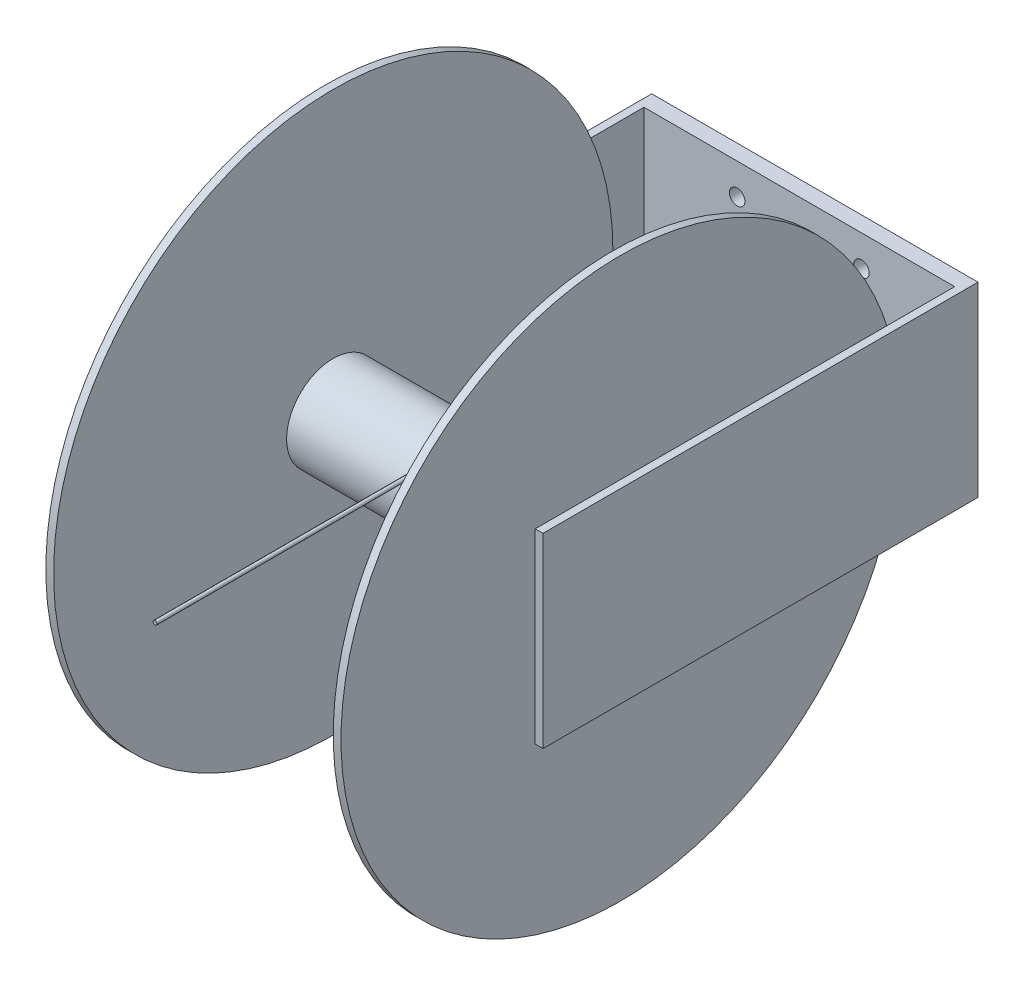
ISO-10303-21;
HEADER;
FILE_DESCRIPTION(('STEP AP214'),'2;1');
FILE_NAME('part.step','',(''),(''),'','','');
FILE_SCHEMA(('AUTOMOTIVE_DESIGN { 1 0 10303 214 1 1 1 1 }'));
ENDSEC;
DATA;
#1=APPLICATION_CONTEXT('core data for automotive mechanical design processes');
#2=APPLICATION_PROTOCOL_DEFINITION('international standard','automotive_design',2000,#1);
#3=PRODUCT_CONTEXT('',#1,'mechanical');
#4=PRODUCT('Part','Part','',(#3));
#5=PRODUCT_RELATED_PRODUCT_CATEGORY('part','',(#4));
#6=PRODUCT_DEFINITION_FORMATION('','',#4);
#7=PRODUCT_DEFINITION_CONTEXT('part definition',#1,'design');
#8=PRODUCT_DEFINITION('design','',#6,#7);
#9=PRODUCT_DEFINITION_SHAPE('','',#8);
#10=(LENGTH_UNIT() NAMED_UNIT(*) SI_UNIT(.MILLI.,.METRE.));
#11=(NAMED_UNIT(*) PLANE_ANGLE_UNIT() SI_UNIT($,.RADIAN.));
#12=(NAMED_UNIT(*) SI_UNIT($,.STERADIAN.) SOLID_ANGLE_UNIT());
#13=UNCERTAINTY_MEASURE_WITH_UNIT(LENGTH_MEASURE(1.E-05),#10,'distance_accuracy_value','');
#14=(GEOMETRIC_REPRESENTATION_CONTEXT(3) GLOBAL_UNCERTAINTY_ASSIGNED_CONTEXT((#13)) GLOBAL_UNIT_ASSIGNED_CONTEXT((#10,
#11,#12)) REPRESENTATION_CONTEXT('',''));
#15=CARTESIAN_POINT('',(0.,0.,0.));
#16=DIRECTION('',(0.,0.,1.));
#17=DIRECTION('',(1.,0.,0.));
#18=AXIS2_PLACEMENT_3D('',#15,#16,#17);
#19=CARTESIAN_POINT('',(234.95,0.,0.));
#20=DIRECTION('',(-1.,0.,0.));
#21=DIRECTION('',(0.,0.,1.));
#22=AXIS2_PLACEMENT_3D('',#19,#20,#21);
#23=CYLINDRICAL_SURFACE('',#22,38.1);
#24=CARTESIAN_POINT('',(6.35,0.,0.));
#25=DIRECTION('',(1.,0.,0.));
#26=DIRECTION('',(0.,0.,-1.));
#27=AXIS2_PLACEMENT_3D('',#24,#25,#26);
#28=CIRCLE('',#27,38.1);
#29=CARTESIAN_POINT('',(6.35,0.,-38.1));
#30=VERTEX_POINT('',#29);
#31=EDGE_CURVE('E270',#30,#30,#28,.T.);
#32=ORIENTED_EDGE('',*,*,#31,.T.);
#33=EDGE_LOOP('',(#32));
#34=FACE_BOUND('',#33,.T.);
#35=CARTESIAN_POINT('',(234.95,0.,0.));
#36=DIRECTION('',(1.,0.,0.));
#37=DIRECTION('',(0.,0.,-1.));
#38=AXIS2_PLACEMENT_3D('',#35,#36,#37);
#39=CIRCLE('',#38,38.1);
#40=CARTESIAN_POINT('',(234.95,0.,-38.1));
#41=VERTEX_POINT('',#40);
#42=EDGE_CURVE('E273',#41,#41,#39,.T.);
#43=ORIENTED_EDGE('',*,*,#42,.F.);
#44=EDGE_LOOP('',(#43));
#45=FACE_BOUND('',#44,.T.);
#46=DIRECTION('',(-1.,0.,0.));
#47=VECTOR('',#46,1.);
#48=CARTESIAN_POINT('',(234.95,0.,-38.1));
#49=LINE('',#48,#47);
#50=CARTESIAN_POINT('',(122.24,0.,-38.1));
#51=VERTEX_POINT('',#50);
#52=CARTESIAN_POINT('',(119.06,0.,-38.1));
#53=VERTEX_POINT('',#52);
#54=EDGE_CURVE('E11',#51,#53,#49,.T.);
#55=ORIENTED_EDGE('',*,*,#54,.F.);
#56=CARTESIAN_POINT('',(122.24,0.,0.));
#57=DIRECTION('',(-1.,0.,0.));
#58=DIRECTION('',(0.,0.,1.));
#59=AXIS2_PLACEMENT_3D('',#56,#57,#58);
#60=CIRCLE('',#59,38.1);
#61=CARTESIAN_POINT('',(122.24,38.1,0.));
#62=VERTEX_POINT('',#61);
#63=EDGE_CURVE('E50',#51,#62,#60,.F.);
#64=ORIENTED_EDGE('',*,*,#63,.T.);
#65=CARTESIAN_POINT('',(122.24,38.1,0.));
#66=CARTESIAN_POINT('',(122.239969843095,38.1000004161451,0.263155413808071));
#67=CARTESIAN_POINT('',(122.239998942787,38.0972736057618,0.526310736584829));
#68=CARTESIAN_POINT('',(122.239958978122,38.0863663180607,1.05261546876357));
#69=CARTESIAN_POINT('',(122.239889873808,38.0781836216027,1.31576483216942));
#70=CARTESIAN_POINT('',(122.239432877307,38.0561912266324,1.84603595109456));
#71=CARTESIAN_POINT('',(122.23903991443,38.0422937980502,2.11315407003681));
#72=CARTESIAN_POINT('',(122.237475772565,38.0088838478478,2.646927723857));
#73=CARTESIAN_POINT('',(122.236304910877,37.9893736174925,2.91358340291642));
#74=CARTESIAN_POINT('',(122.232545223609,37.944564627655,3.44857246255277));
#75=CARTESIAN_POINT('',(122.229945000416,37.9192203044745,3.71690195813133));
#76=CARTESIAN_POINT('',(122.222471621423,37.862844960689,4.25295275488759));
#77=CARTESIAN_POINT('',(122.21759830794,37.831813545664,4.52067401257729));
#78=CARTESIAN_POINT('',(122.204480048913,37.7640120175987,5.05592025545366));
#79=CARTESIAN_POINT('',(122.196227576689,37.7272292077921,5.32344345822355));
#80=CARTESIAN_POINT('',(122.174958659612,37.6480192529511,5.85742947218407));
#81=CARTESIAN_POINT('',(122.161942990631,37.605593027882,6.12389244893203));
#82=CARTESIAN_POINT('',(122.129557153402,37.5158304217406,6.65154314826663));
#83=CARTESIAN_POINT('',(122.110283835843,37.4685759611548,6.91275059671003));
#84=CARTESIAN_POINT('',(122.062950882956,37.3687346803761,7.433570740661));
#85=CARTESIAN_POINT('',(122.034885660134,37.3161444835894,7.69318231466648));
#86=CARTESIAN_POINT('',(121.98359070811,37.2335902820844,8.08004124599994));
#87=CARTESIAN_POINT('',(121.96500627531,37.2055210832138,8.20831137384597));
#88=CARTESIAN_POINT('',(121.924128812276,37.1481908842843,8.46398650786794));
#89=CARTESIAN_POINT('',(121.901836183779,37.1189300135873,8.59139160620452));
#90=CARTESIAN_POINT('',(121.852747683156,37.0593335935228,8.84492704914932));
#91=CARTESIAN_POINT('',(121.825956957555,37.0289993032702,8.97105867791002));
#92=CARTESIAN_POINT('',(121.766726769547,36.9673670338524,9.22173574509855));
#93=CARTESIAN_POINT('',(121.734289425277,36.9360694196561,9.34628175958211));
#94=CARTESIAN_POINT('',(121.683729726594,36.8917503436196,9.51899985894595));
#95=CARTESIAN_POINT('',(121.668696250618,36.8790306671258,9.56815846415023));
#96=CARTESIAN_POINT('',(121.637290614157,36.8534976108575,9.66603696315275));
#97=CARTESIAN_POINT('',(121.620918156103,36.8406842108335,9.71475675674618));
#98=CARTESIAN_POINT('',(121.586533195724,36.8149043905008,9.81200098548411));
#99=CARTESIAN_POINT('',(121.568509601341,36.8019375357816,9.8605214032649));
#100=CARTESIAN_POINT('',(121.530696568847,36.7759913058391,9.95685449209732));
#101=CARTESIAN_POINT('',(121.510907545198,36.7630119342584,10.0046673262089));
#102=CARTESIAN_POINT('',(121.463881532591,36.7337449999586,10.1116663390797));
#103=CARTESIAN_POINT('',(121.436042202015,36.7174703262293,10.1705946416461));
#104=CARTESIAN_POINT('',(121.376326991115,36.6851846071208,10.2864395701272));
#105=CARTESIAN_POINT('',(121.344453182936,36.6691734311436,10.3433572096766));
#106=CARTESIAN_POINT('',(121.275837808016,36.6378641203528,10.4537157976531));
#107=CARTESIAN_POINT('',(121.239140129186,36.6225610644857,10.5071822825237));
#108=CARTESIAN_POINT('',(121.159177020163,36.5931300729919,10.6092229873517));
#109=CARTESIAN_POINT('',(121.115937803826,36.5789977807712,10.6578155009806));
#110=CARTESIAN_POINT('',(121.040227643619,36.5583565800884,10.7283420501423));
#111=CARTESIAN_POINT('',(121.010581569053,36.5510931306797,10.7530529301458));
#112=CARTESIAN_POINT('',(120.94784539167,36.5378180007853,10.7980739461555));
#113=CARTESIAN_POINT('',(120.914762896266,36.5318036401208,10.8183935085296));
#114=CARTESIAN_POINT('',(120.854719749063,36.5230285427257,10.8479748161292));
#115=CARTESIAN_POINT('',(120.82857412385,36.5198278809154,10.8587408251734));
#116=CARTESIAN_POINT('',(120.774791300026,36.5146754085366,10.8760545329939));
#117=CARTESIAN_POINT('',(120.747155582919,36.5127223814742,10.8826063408283));
#118=CARTESIAN_POINT('',(120.690880030731,36.5102749141819,10.8908147496676));
#119=CARTESIAN_POINT('',(120.662234480347,36.5097908778629,10.8924364339366));
#120=CARTESIAN_POINT('',(120.605140378659,36.5103764849778,10.8904733445936));
#121=CARTESIAN_POINT('',(120.576691844065,36.5114462586188,10.8868881346511));
#122=CARTESIAN_POINT('',(120.523571604254,36.5148316884153,10.8755274024679));
#123=CARTESIAN_POINT('',(120.498796758475,36.5170203119781,10.8681790187873));
#124=CARTESIAN_POINT('',(120.450595395759,36.5223667507563,10.850198855739));
#125=CARTESIAN_POINT('',(120.427169497509,36.5255250065489,10.839565583785));
#126=CARTESIAN_POINT('',(120.36606624085,36.5350727141602,10.807354074565));
#127=CARTESIAN_POINT('',(120.329810278151,36.5421816424694,10.7833075005775));
#128=CARTESIAN_POINT('',(120.261471378718,36.5577992675802,10.7302415087662));
#129=CARTESIAN_POINT('',(120.22940317502,36.5663126798161,10.7012053245945));
#130=CARTESIAN_POINT('',(120.16991937712,36.5839034773035,10.640909781304));
#131=CARTESIAN_POINT('',(120.142382867907,36.5929519396047,10.6097592320349));
#132=CARTESIAN_POINT('',(120.090119123394,36.6115768103337,10.5453103852001));
#133=CARTESIAN_POINT('',(120.065394726753,36.6211537379885,10.5120099696901));
#134=CARTESIAN_POINT('',(120.018270777876,36.6406613809053,10.4438113096789));
#135=CARTESIAN_POINT('',(119.995876091037,36.6505927806093,10.4089099322464));
#136=CARTESIAN_POINT('',(119.953111662025,36.6706634109839,10.3379787619076));
#137=CARTESIAN_POINT('',(119.932741042223,36.680802549259,10.3019494670535));
#138=CARTESIAN_POINT('',(119.881530635278,36.7075779569144,10.2062479171353));
#139=CARTESIAN_POINT('',(119.852092906325,36.7243192686632,10.1458556586232));
#140=CARTESIAN_POINT('',(119.796805938528,36.7579123494187,10.0234684858305));
#141=CARTESIAN_POINT('',(119.770958693401,36.7747641743958,9.96147270363118));
#142=CARTESIAN_POINT('',(119.697710609445,36.8253240409761,9.77355202554346));
#143=CARTESIAN_POINT('',(119.654707628467,36.8589781988582,9.64590157732037));
#144=CARTESIAN_POINT('',(119.576824657429,36.9256872270212,9.38731015798063));
#145=CARTESIAN_POINT('',(119.541988734304,36.9587379972114,9.25635537642101));
#146=CARTESIAN_POINT('',(119.494555844171,37.0074994885612,9.05867459731237));
#147=CARTESIAN_POINT('',(119.479555619815,37.0236085155956,8.99261123533743));
#148=CARTESIAN_POINT('',(119.450973812094,37.0555404222101,8.86011104028594));
#149=CARTESIAN_POINT('',(119.437392203342,37.0713633069068,8.79367421391518));
#150=CARTESIAN_POINT('',(119.39829400803,37.1186638489986,8.59266291087793));
#151=CARTESIAN_POINT('',(119.374708826089,37.149673828485,8.45760114252441));
#152=CARTESIAN_POINT('',(119.331665432958,37.2103518463302,8.1865143834975));
#153=CARTESIAN_POINT('',(119.312207837569,37.2400196839336,8.05048925222211));
#154=CARTESIAN_POINT('',(119.276687044381,37.2979607496048,7.77763359583541));
#155=CARTESIAN_POINT('',(119.260625514222,37.32623328731,7.64080270879709));
#156=CARTESIAN_POINT('',(119.231346027618,37.3813270394853,7.36654315977161));
#157=CARTESIAN_POINT('',(119.218128225964,37.4081481748925,7.22911446565952));
#158=CARTESIAN_POINT('',(119.181987188477,37.4865088715253,6.81546232520132));
#159=CARTESIAN_POINT('',(119.162653140494,37.5358128296526,6.53849820982159));
#160=CARTESIAN_POINT('',(119.130794184371,37.6283102377883,5.98326698100739));
#161=CARTESIAN_POINT('',(119.118267504154,37.6715052758874,5.7050002257153));
#162=CARTESIAN_POINT('',(119.098061046779,37.7517255211018,5.1474767334544));
#163=CARTESIAN_POINT('',(119.090380129021,37.7887521786246,4.86822024502399));
#164=CARTESIAN_POINT('',(119.078361614241,37.8566112471615,4.30887037138074));
#165=CARTESIAN_POINT('',(119.074024247101,37.8874432321596,4.0287769299529));
#166=CARTESIAN_POINT('',(119.067539328917,37.9428550517803,3.46827997752443));
#167=CARTESIAN_POINT('',(119.065389228762,37.9674421392597,3.18787720961085));
#168=CARTESIAN_POINT('',(119.062380655193,38.0103955533865,2.62660295204167));
#169=CARTESIAN_POINT('',(119.061522112517,38.0287622135734,2.34573148832938));
#170=CARTESIAN_POINT('',(119.060657649128,38.0533541127935,1.89260276326684));
#171=CARTESIAN_POINT('',(119.060450224007,38.0615259595373,1.72044898173962));
#172=CARTESIAN_POINT('',(119.060172713216,38.0755336468585,1.37602554462067));
#173=CARTESIAN_POINT('',(119.060102643457,38.0813692167537,1.2037558779172));
#174=CARTESIAN_POINT('',(119.060020106428,38.0906903271651,0.859577594519716));
#175=CARTESIAN_POINT('',(119.060007497774,38.0941816177204,0.687669133047689));
#176=CARTESIAN_POINT('',(119.060000166878,38.0988363558348,0.343840479878958));
#177=CARTESIAN_POINT('',(119.060005442579,38.1000000711801,0.171920291807591));
#178=CARTESIAN_POINT('',(119.06,38.1,0.));
#179=B_SPLINE_CURVE_WITH_KNOTS('',3,(#65,#66,#67,#68,#69,#70,#71,#72,#73,#74,#75,#76,#77,#78,
#79,#80,#81,#82,#83,#84,#85,#86,#87,#88,#89,#90,#91,#92,#93,#94,#95,#96,#97,#98,#99,#100,#101,
#102,#103,#104,#105,#106,#107,#108,#109,#110,#111,#112,#113,#114,#115,#116,#117,#118,#119,#120,
#121,#122,#123,#124,#125,#126,#127,#128,#129,#130,#131,#132,#133,#134,#135,#136,#137,#138,#139,
#140,#141,#142,#143,#144,#145,#146,#147,#148,#149,#150,#151,#152,#153,#154,#155,#156,#157,#158,
#159,#160,#161,#162,#163,#164,#165,#166,#167,#168,#169,#170,#171,#172,#173,#174,#175,#176,#177,
#178),.UNSPECIFIED.,.F.,.F.,(4,2,2,2,2,2,2,2,2,2,2,2,2,2,2,2,2,2,2,2,2,2,2,2,2,2,2,2,2,2,2,2,2,
2,2,2,2,2,2,2,2,2,2,2,2,2,2,2,2,2,2,2,2,2,2,2,4),(0.,0.789451932615881,1.57922516486945,
2.38160427101652,3.18365629262403,3.9921985865225,4.80079697690844,5.61120630797448,
6.42148369111613,7.21977460188174,8.01857388090153,8.41637024841033,8.81412354767219,
9.21142481831712,9.60857737488789,9.76743148395468,9.9263209925052,10.0863695125873,
10.24638055703,10.4477894939342,10.6490954019378,10.8486824310892,11.0474898637521,
11.1650174436762,11.2822901772325,11.3673452798729,11.4523173232866,11.5378897805807,
11.6234694091416,11.7009769326306,11.7785197258899,11.9100007417811,12.0419325296987,
12.1693894526089,12.2969739147413,12.4248196916323,12.5526097908213,12.7601664414675,
12.9678378869643,13.3838966463735,13.8021511622012,14.0110384150688,14.2199219291298,
14.6415320934717,15.0632051144447,15.485084719858,15.9069872834181,16.7527226948341,
17.5982378409487,18.4435538946638,19.2889280620225,20.1333158709851,20.9776583966562,
21.4946875813557,22.0117766519963,22.5275927298304,23.0433494599267),.UNSPECIFIED.);
#180=CARTESIAN_POINT('',(119.06,38.1,0.));
#181=VERTEX_POINT('',#180);
#182=EDGE_CURVE('E128',#62,#181,#179,.T.);
#183=ORIENTED_EDGE('',*,*,#182,.T.);
#184=CARTESIAN_POINT('',(119.06,0.,0.));
#185=DIRECTION('',(1.,0.,0.));
#186=DIRECTION('',(0.,0.,-1.));
#187=AXIS2_PLACEMENT_3D('',#184,#185,#186);
#188=CIRCLE('',#187,38.1);
#189=EDGE_CURVE('E134',#181,#53,#188,.F.);
#190=ORIENTED_EDGE('',*,*,#189,.T.);
#191=EDGE_LOOP('',(#55,#64,#183,#190));
#192=FACE_BOUND('',#191,.T.);
#193=ADVANCED_FACE('F41',(#34,#45,#192),#23,.T.);
#194=CARTESIAN_POINT('',(247.65,0.,0.));
#195=DIRECTION('',(-1.,0.,0.));
#196=DIRECTION('',(0.,0.,1.));
#197=AXIS2_PLACEMENT_3D('',#194,#195,#196);
#198=PLANE('',#197);
#199=CARTESIAN_POINT('',(247.65,0.,0.));
#200=DIRECTION('',(1.,0.,0.));
#201=DIRECTION('',(0.,0.,-1.));
#202=AXIS2_PLACEMENT_3D('',#199,#200,#201);
#203=CIRCLE('',#202,38.1);
#204=CARTESIAN_POINT('',(247.65,0.,-38.1));
#205=VERTEX_POINT('',#204);
#206=EDGE_CURVE('E518',#205,#205,#203,.T.);
#207=ORIENTED_EDGE('',*,*,#206,.T.);
#208=EDGE_LOOP('',(#207));
#209=FACE_BOUND('',#208,.T.);
#210=DIRECTION('',(0.,0.,1.));
#211=VECTOR('',#210,1.);
#212=CARTESIAN_POINT('',(247.65,76.1999999999987,5.02850911176981));
#213=LINE('',#212,#211);
#214=CARTESIAN_POINT('',(247.65,76.1999999999983,-266.7));
#215=VERTEX_POINT('',#214);
#216=CARTESIAN_POINT('',(247.65,76.1999999999987,76.2));
#217=VERTEX_POINT('',#216);
#218=EDGE_CURVE('E539',#215,#217,#213,.T.);
#219=ORIENTED_EDGE('',*,*,#218,.F.);
#220=DIRECTION('',(0.,1.,0.));
#221=VECTOR('',#220,1.);
#222=CARTESIAN_POINT('',(247.65,76.1999999999983,-266.7));
#223=LINE('',#222,#221);
#224=CARTESIAN_POINT('',(247.65,-75.4351081042018,-266.7));
#225=VERTEX_POINT('',#224);
#226=EDGE_CURVE('E622',#225,#215,#223,.T.);
#227=ORIENTED_EDGE('',*,*,#226,.F.);
#228=DIRECTION('',(0.,0.,1.));
#229=VECTOR('',#228,1.);
#230=CARTESIAN_POINT('',(247.65,-75.4351081042018,-279.4));
#231=LINE('',#230,#229);
#232=CARTESIAN_POINT('',(247.65,-75.4351081042018,-279.4));
#233=VERTEX_POINT('',#232);
#234=EDGE_CURVE('E626',#233,#225,#231,.T.);
#235=ORIENTED_EDGE('',*,*,#234,.F.);
#236=DIRECTION('',(0.,1.,0.));
#237=VECTOR('',#236,1.);
#238=CARTESIAN_POINT('',(247.65,76.1999999999983,-279.4));
#239=LINE('',#238,#237);
#240=CARTESIAN_POINT('',(247.65,-76.2000000000006,-279.4));
#241=VERTEX_POINT('',#240);
#242=EDGE_CURVE('E561',#241,#233,#239,.T.);
#243=ORIENTED_EDGE('',*,*,#242,.F.);
#244=DIRECTION('',(0.,0.,-1.));
#245=VECTOR('',#244,1.);
#246=CARTESIAN_POINT('',(247.65,-76.2000000000006,-76.2));
#247=LINE('',#246,#245);
#248=CARTESIAN_POINT('',(247.65,-76.2000000000006,76.2));
#249=VERTEX_POINT('',#248);
#250=EDGE_CURVE('E543',#249,#241,#247,.T.);
#251=ORIENTED_EDGE('',*,*,#250,.F.);
#252=DIRECTION('',(0.,-1.,0.));
#253=VECTOR('',#252,1.);
#254=CARTESIAN_POINT('',(247.65,-76.2000000000006,76.2));
#255=LINE('',#254,#253);
#256=EDGE_CURVE('E546',#217,#249,#255,.T.);
#257=ORIENTED_EDGE('',*,*,#256,.F.);
#258=EDGE_LOOP('',(#219,#227,#235,#243,#251,#257));
#259=FACE_BOUND('',#258,.T.);
#260=ADVANCED_FACE('F205',(#209,#259),#198,.T.);
#261=CARTESIAN_POINT('',(-6.35,0.,0.));
#262=DIRECTION('',(1.,0.,0.));
#263=DIRECTION('',(0.,0.,-1.));
#264=AXIS2_PLACEMENT_3D('',#261,#262,#263);
#265=PLANE('',#264);
#266=CARTESIAN_POINT('',(-6.35,0.,0.));
#267=DIRECTION('',(-1.,0.,0.));
#268=DIRECTION('',(0.,0.,1.));
#269=AXIS2_PLACEMENT_3D('',#266,#267,#268);
#270=CIRCLE('',#269,38.1);
#271=CARTESIAN_POINT('',(-6.35,0.,38.1));
#272=VERTEX_POINT('',#271);
#273=EDGE_CURVE('E516',#272,#272,#270,.T.);
#274=ORIENTED_EDGE('',*,*,#273,.T.);
#275=EDGE_LOOP('',(#274));
#276=FACE_BOUND('',#275,.T.);
#277=DIRECTION('',(0.,0.,-1.));
#278=VECTOR('',#277,1.);
#279=CARTESIAN_POINT('',(-6.34999999999999,-75.4351081042018,-279.4));
#280=LINE('',#279,#278);
#281=CARTESIAN_POINT('',(-6.34999999999999,-75.4351081042018,-266.7));
#282=VERTEX_POINT('',#281);
#283=CARTESIAN_POINT('',(-6.35,-75.4351081042018,-279.4));
#284=VERTEX_POINT('',#283);
#285=EDGE_CURVE('E64',#282,#284,#280,.T.);
#286=ORIENTED_EDGE('',*,*,#285,.F.);
#287=DIRECTION('',(0.,-1.,0.));
#288=VECTOR('',#287,1.);
#289=CARTESIAN_POINT('',(-6.34999999999999,76.1999999999983,-266.7));
#290=LINE('',#289,#288);
#291=CARTESIAN_POINT('',(-6.34999999999999,76.1999999999983,-266.7));
#292=VERTEX_POINT('',#291);
#293=EDGE_CURVE('E615',#292,#282,#290,.T.);
#294=ORIENTED_EDGE('',*,*,#293,.F.);
#295=DIRECTION('',(0.,0.,-1.));
#296=VECTOR('',#295,1.);
#297=CARTESIAN_POINT('',(-6.35,76.2,-76.2));
#298=LINE('',#297,#296);
#299=CARTESIAN_POINT('',(-6.35,76.2,76.2));
#300=VERTEX_POINT('',#299);
#301=EDGE_CURVE('E592',#300,#292,#298,.T.);
#302=ORIENTED_EDGE('',*,*,#301,.F.);
#303=DIRECTION('',(0.,1.,0.));
#304=VECTOR('',#303,1.);
#305=CARTESIAN_POINT('',(-6.35,-76.2,76.2));
#306=LINE('',#305,#304);
#307=CARTESIAN_POINT('',(-6.35,-76.2,76.2));
#308=VERTEX_POINT('',#307);
#309=EDGE_CURVE('E596',#308,#300,#306,.T.);
#310=ORIENTED_EDGE('',*,*,#309,.F.);
#311=DIRECTION('',(0.,0.,1.));
#312=VECTOR('',#311,1.);
#313=CARTESIAN_POINT('',(-6.35,-76.2,-76.2));
#314=LINE('',#313,#312);
#315=CARTESIAN_POINT('',(-6.35,-76.2,-279.4));
#316=VERTEX_POINT('',#315);
#317=EDGE_CURVE('E585',#316,#308,#314,.T.);
#318=ORIENTED_EDGE('',*,*,#317,.F.);
#319=DIRECTION('',(0.,-1.,0.));
#320=VECTOR('',#319,1.);
#321=CARTESIAN_POINT('',(-6.35,76.1999999999999,-279.4));
#322=LINE('',#321,#320);
#323=EDGE_CURVE('E589',#284,#316,#322,.T.);
#324=ORIENTED_EDGE('',*,*,#323,.F.);
#325=EDGE_LOOP('',(#286,#294,#302,#310,#318,#324));
#326=FACE_BOUND('',#325,.T.);
#327=ADVANCED_FACE('F202',(#276,#326),#265,.T.);
#328=CARTESIAN_POINT('',(6.35,0.,0.));
#329=DIRECTION('',(-1.,0.,0.));
#330=DIRECTION('',(0.,0.,1.));
#331=AXIS2_PLACEMENT_3D('',#328,#329,#330);
#332=CYLINDRICAL_SURFACE('',#331,228.6);
#333=CARTESIAN_POINT('',(6.35,0.,0.));
#334=DIRECTION('',(1.,0.,0.));
#335=DIRECTION('',(0.,0.,-1.));
#336=AXIS2_PLACEMENT_3D('',#333,#334,#335);
#337=CIRCLE('',#336,228.6);
#338=CARTESIAN_POINT('',(6.35,0.,-228.6));
#339=VERTEX_POINT('',#338);
#340=EDGE_CURVE('E280',#339,#339,#337,.T.);
#341=ORIENTED_EDGE('',*,*,#340,.F.);
#342=EDGE_LOOP('',(#341));
#343=FACE_BOUND('',#342,.T.);
#344=CARTESIAN_POINT('',(0.,0.,0.));
#345=DIRECTION('',(1.,0.,0.));
#346=DIRECTION('',(0.,0.,-1.));
#347=AXIS2_PLACEMENT_3D('',#344,#345,#346);
#348=CIRCLE('',#347,228.6);
#349=CARTESIAN_POINT('',(0.,0.,-228.6));
#350=VERTEX_POINT('',#349);
#351=EDGE_CURVE('E156',#350,#350,#348,.T.);
#352=ORIENTED_EDGE('',*,*,#351,.T.);
#353=EDGE_LOOP('',(#352));
#354=FACE_BOUND('',#353,.T.);
#355=ADVANCED_FACE('F43',(#343,#354),#332,.T.);
#356=CARTESIAN_POINT('',(6.35,0.,0.));
#357=DIRECTION('',(1.,0.,0.));
#358=DIRECTION('',(0.,0.,-1.));
#359=AXIS2_PLACEMENT_3D('',#356,#357,#358);
#360=PLANE('',#359);
#361=ORIENTED_EDGE('',*,*,#31,.F.);
#362=EDGE_LOOP('',(#361));
#363=FACE_BOUND('',#362,.T.);
#364=ORIENTED_EDGE('',*,*,#340,.T.);
#365=EDGE_LOOP('',(#364));
#366=FACE_BOUND('',#365,.T.);
#367=ADVANCED_FACE('F259',(#363,#366),#360,.T.);
#368=CARTESIAN_POINT('',(0.,0.,0.));
#369=DIRECTION('',(1.,0.,0.));
#370=DIRECTION('',(0.,0.,-1.));
#371=AXIS2_PLACEMENT_3D('',#368,#369,#370);
#372=PLANE('',#371);
#373=CARTESIAN_POINT('',(0.,0.,0.));
#374=DIRECTION('',(-1.,0.,0.));
#375=DIRECTION('',(0.,0.,1.));
#376=AXIS2_PLACEMENT_3D('',#373,#374,#375);
#377=CIRCLE('',#376,38.1);
#378=CARTESIAN_POINT('',(0.,0.,38.1));
#379=VERTEX_POINT('',#378);
#380=EDGE_CURVE('E135',#379,#379,#377,.T.);
#381=ORIENTED_EDGE('',*,*,#380,.F.);
#382=EDGE_LOOP('',(#381));
#383=FACE_BOUND('',#382,.T.);
#384=ORIENTED_EDGE('',*,*,#351,.F.);
#385=EDGE_LOOP('',(#384));
#386=FACE_BOUND('',#385,.T.);
#387=ADVANCED_FACE('F254',(#383,#386),#372,.F.);
#388=CARTESIAN_POINT('',(241.3,0.,0.));
#389=DIRECTION('',(-1.,0.,0.));
#390=DIRECTION('',(0.,0.,1.));
#391=AXIS2_PLACEMENT_3D('',#388,#389,#390);
#392=CYLINDRICAL_SURFACE('',#391,228.6);
#393=CARTESIAN_POINT('',(241.3,0.,0.));
#394=DIRECTION('',(1.,0.,0.));
#395=DIRECTION('',(0.,0.,-1.));
#396=AXIS2_PLACEMENT_3D('',#393,#394,#395);
#397=CIRCLE('',#396,228.6);
#398=CARTESIAN_POINT('',(241.3,0.,-228.6));
#399=VERTEX_POINT('',#398);
#400=EDGE_CURVE('E275',#399,#399,#397,.T.);
#401=ORIENTED_EDGE('',*,*,#400,.F.);
#402=EDGE_LOOP('',(#401));
#403=FACE_BOUND('',#402,.T.);
#404=CARTESIAN_POINT('',(234.95,0.,0.));
#405=DIRECTION('',(1.,0.,0.));
#406=DIRECTION('',(0.,0.,-1.));
#407=AXIS2_PLACEMENT_3D('',#404,#405,#406);
#408=CIRCLE('',#407,228.6);
#409=CARTESIAN_POINT('',(234.95,0.,-228.6));
#410=VERTEX_POINT('',#409);
#411=EDGE_CURVE('E282',#410,#410,#408,.T.);
#412=ORIENTED_EDGE('',*,*,#411,.T.);
#413=EDGE_LOOP('',(#412));
#414=FACE_BOUND('',#413,.T.);
#415=ADVANCED_FACE('F249',(#403,#414),#392,.T.);
#416=CARTESIAN_POINT('',(241.3,0.,0.));
#417=DIRECTION('',(1.,0.,0.));
#418=DIRECTION('',(0.,0.,-1.));
#419=AXIS2_PLACEMENT_3D('',#416,#417,#418);
#420=PLANE('',#419);
#421=CARTESIAN_POINT('',(241.3,0.,0.));
#422=DIRECTION('',(1.,0.,0.));
#423=DIRECTION('',(0.,0.,-1.));
#424=AXIS2_PLACEMENT_3D('',#421,#422,#423);
#425=CIRCLE('',#424,38.1);
#426=CARTESIAN_POINT('',(241.3,0.,-38.1));
#427=VERTEX_POINT('',#426);
#428=EDGE_CURVE('E287',#427,#427,#425,.T.);
#429=ORIENTED_EDGE('',*,*,#428,.F.);
#430=EDGE_LOOP('',(#429));
#431=FACE_BOUND('',#430,.T.);
#432=ORIENTED_EDGE('',*,*,#400,.T.);
#433=EDGE_LOOP('',(#432));
#434=FACE_BOUND('',#433,.T.);
#435=ADVANCED_FACE('F246',(#431,#434),#420,.T.);
#436=CARTESIAN_POINT('',(234.95,0.,0.));
#437=DIRECTION('',(1.,0.,0.));
#438=DIRECTION('',(0.,0.,-1.));
#439=AXIS2_PLACEMENT_3D('',#436,#437,#438);
#440=PLANE('',#439);
#441=ORIENTED_EDGE('',*,*,#42,.T.);
#442=EDGE_LOOP('',(#441));
#443=FACE_BOUND('',#442,.T.);
#444=ORIENTED_EDGE('',*,*,#411,.F.);
#445=EDGE_LOOP('',(#444));
#446=FACE_BOUND('',#445,.T.);
#447=ADVANCED_FACE('F244',(#443,#446),#440,.F.);
#448=CARTESIAN_POINT('',(247.65,0.,0.));
#449=DIRECTION('',(-1.,0.,0.));
#450=DIRECTION('',(0.,0.,1.));
#451=AXIS2_PLACEMENT_3D('',#448,#449,#450);
#452=CYLINDRICAL_SURFACE('',#451,38.1);
#453=ORIENTED_EDGE('',*,*,#206,.F.);
#454=EDGE_LOOP('',(#453));
#455=FACE_BOUND('',#454,.T.);
#456=ORIENTED_EDGE('',*,*,#428,.T.);
#457=EDGE_LOOP('',(#456));
#458=FACE_BOUND('',#457,.T.);
#459=ADVANCED_FACE('F240',(#455,#458),#452,.T.);
#460=CARTESIAN_POINT('',(-6.35,0.,0.));
#461=DIRECTION('',(1.,0.,0.));
#462=DIRECTION('',(0.,0.,-1.));
#463=AXIS2_PLACEMENT_3D('',#460,#461,#462);
#464=CYLINDRICAL_SURFACE('',#463,38.1);
#465=ORIENTED_EDGE('',*,*,#273,.F.);
#466=EDGE_LOOP('',(#465));
#467=FACE_BOUND('',#466,.T.);
#468=ORIENTED_EDGE('',*,*,#380,.T.);
#469=EDGE_LOOP('',(#468));
#470=FACE_BOUND('',#469,.T.);
#471=ADVANCED_FACE('F236',(#467,#470),#464,.T.);
#472=CARTESIAN_POINT('',(254.,-76.2000000000006,76.2));
#473=DIRECTION('',(0.,0.,-1.));
#474=DIRECTION('',(-1.,0.,0.));
#475=AXIS2_PLACEMENT_3D('',#472,#473,#474);
#476=PLANE('',#475);
#477=ORIENTED_EDGE('',*,*,#256,.T.);
#478=DIRECTION('',(-1.,0.,0.));
#479=VECTOR('',#478,1.);
#480=CARTESIAN_POINT('',(254.,-76.2000000000006,76.2));
#481=LINE('',#480,#479);
#482=CARTESIAN_POINT('',(254.,-76.2000000000006,76.2));
#483=VERTEX_POINT('',#482);
#484=EDGE_CURVE('E526',#483,#249,#481,.T.);
#485=ORIENTED_EDGE('',*,*,#484,.F.);
#486=DIRECTION('',(0.,-1.,0.));
#487=VECTOR('',#486,1.);
#488=CARTESIAN_POINT('',(254.,76.1999999999987,76.2));
#489=LINE('',#488,#487);
#490=CARTESIAN_POINT('',(254.,76.1999999999987,76.2));
#491=VERTEX_POINT('',#490);
#492=EDGE_CURVE('E542',#491,#483,#489,.T.);
#493=ORIENTED_EDGE('',*,*,#492,.F.);
#494=DIRECTION('',(-1.,0.,0.));
#495=VECTOR('',#494,1.);
#496=CARTESIAN_POINT('',(254.,76.1999999999987,76.2));
#497=LINE('',#496,#495);
#498=EDGE_CURVE('E530',#491,#217,#497,.T.);
#499=ORIENTED_EDGE('',*,*,#498,.T.);
#500=EDGE_LOOP('',(#477,#485,#493,#499));
#501=FACE_BOUND('',#500,.T.);
#502=ADVANCED_FACE('F232',(#501),#476,.F.);
#503=CARTESIAN_POINT('',(254.,-76.2000000000006,-76.2));
#504=DIRECTION('',(0.,1.,0.));
#505=DIRECTION('',(0.,0.,1.));
#506=AXIS2_PLACEMENT_3D('',#503,#504,#505);
#507=PLANE('',#506);
#508=ORIENTED_EDGE('',*,*,#250,.T.);
#509=DIRECTION('',(1.,0.,0.));
#510=VECTOR('',#509,1.);
#511=CARTESIAN_POINT('',(247.65,-76.2000000000006,-279.4));
#512=LINE('',#511,#510);
#513=CARTESIAN_POINT('',(254.,-76.2000000000006,-279.4));
#514=VERTEX_POINT('',#513);
#515=EDGE_CURVE('E557',#241,#514,#512,.T.);
#516=ORIENTED_EDGE('',*,*,#515,.T.);
#517=DIRECTION('',(0.,0.,-1.));
#518=VECTOR('',#517,1.);
#519=CARTESIAN_POINT('',(254.,-76.2000000000006,-76.2));
#520=LINE('',#519,#518);
#521=EDGE_CURVE('E552',#483,#514,#520,.T.);
#522=ORIENTED_EDGE('',*,*,#521,.F.);
#523=ORIENTED_EDGE('',*,*,#484,.T.);
#524=EDGE_LOOP('',(#508,#516,#522,#523));
#525=FACE_BOUND('',#524,.T.);
#526=ADVANCED_FACE('F228',(#525),#507,.F.);
#527=CARTESIAN_POINT('',(254.,76.1999999999987,5.02850911176981));
#528=DIRECTION('',(0.,-1.,0.));
#529=DIRECTION('',(0.,0.,-1.));
#530=AXIS2_PLACEMENT_3D('',#527,#528,#529);
#531=PLANE('',#530);
#532=DIRECTION('',(1.,0.,0.));
#533=VECTOR('',#532,1.);
#534=CARTESIAN_POINT('',(247.65,76.1999999999983,-279.4));
#535=LINE('',#534,#533);
#536=CARTESIAN_POINT('',(-12.7,76.1999999999999,-279.4));
#537=VERTEX_POINT('',#536);
#538=CARTESIAN_POINT('',(254.,76.1999999999983,-279.4));
#539=VERTEX_POINT('',#538);
#540=EDGE_CURVE('E549',#537,#539,#535,.T.);
#541=ORIENTED_EDGE('',*,*,#540,.F.);
#542=DIRECTION('',(0.,0.,-1.));
#543=VECTOR('',#542,1.);
#544=CARTESIAN_POINT('',(-12.7,76.2,-76.2));
#545=LINE('',#544,#543);
#546=CARTESIAN_POINT('',(-12.7,76.2,76.2));
#547=VERTEX_POINT('',#546);
#548=EDGE_CURVE('E605',#547,#537,#545,.T.);
#549=ORIENTED_EDGE('',*,*,#548,.F.);
#550=DIRECTION('',(1.,0.,0.));
#551=VECTOR('',#550,1.);
#552=CARTESIAN_POINT('',(-12.7,76.2,76.2));
#553=LINE('',#552,#551);
#554=EDGE_CURVE('E569',#547,#300,#553,.T.);
#555=ORIENTED_EDGE('',*,*,#554,.T.);
#556=ORIENTED_EDGE('',*,*,#301,.T.);
#557=DIRECTION('',(1.,0.,0.));
#558=VECTOR('',#557,1.);
#559=CARTESIAN_POINT('',(-158.516014634584,76.1999999999983,-266.7));
#560=LINE('',#559,#558);
#561=EDGE_CURVE('E619',#292,#215,#560,.T.);
#562=ORIENTED_EDGE('',*,*,#561,.T.);
#563=ORIENTED_EDGE('',*,*,#218,.T.);
#564=ORIENTED_EDGE('',*,*,#498,.F.);
#565=DIRECTION('',(0.,0.,1.));
#566=VECTOR('',#565,1.);
#567=CARTESIAN_POINT('',(254.,76.1999999999987,5.02850911176981));
#568=LINE('',#567,#566);
#569=EDGE_CURVE('E536',#539,#491,#568,.T.);
#570=ORIENTED_EDGE('',*,*,#569,.F.);
#571=EDGE_LOOP('',(#541,#549,#555,#556,#562,#563,#564,#570));
#572=FACE_BOUND('',#571,.T.);
#573=ADVANCED_FACE('F221',(#572),#531,.F.);
#574=CARTESIAN_POINT('',(254.,0.,0.));
#575=DIRECTION('',(-1.,0.,0.));
#576=DIRECTION('',(0.,0.,1.));
#577=AXIS2_PLACEMENT_3D('',#574,#575,#576);
#578=PLANE('',#577);
#579=ORIENTED_EDGE('',*,*,#492,.T.);
#580=ORIENTED_EDGE('',*,*,#521,.T.);
#581=DIRECTION('',(0.,1.,0.));
#582=VECTOR('',#581,1.);
#583=CARTESIAN_POINT('',(254.,76.1999999999983,-279.4));
#584=LINE('',#583,#582);
#585=EDGE_CURVE('E565',#514,#539,#584,.T.);
#586=ORIENTED_EDGE('',*,*,#585,.T.);
#587=ORIENTED_EDGE('',*,*,#569,.T.);
#588=EDGE_LOOP('',(#579,#580,#586,#587));
#589=FACE_BOUND('',#588,.T.);
#590=ADVANCED_FACE('F217',(#589),#578,.F.);
#591=CARTESIAN_POINT('',(247.65,76.1999999999983,-279.4));
#592=DIRECTION('',(0.,0.,-1.));
#593=DIRECTION('',(-1.,0.,0.));
#594=AXIS2_PLACEMENT_3D('',#591,#592,#593);
#595=PLANE('',#594);
#596=CARTESIAN_POINT('',(171.449999999999,-50.8000000000017,-279.4));
#597=DIRECTION('',(0.,0.,-1.));
#598=DIRECTION('',(-1.,0.,0.));
#599=AXIS2_PLACEMENT_3D('',#596,#597,#598);
#600=CIRCLE('',#599,6.35);
#601=CARTESIAN_POINT('',(165.099999999999,-50.8000000000017,-279.4));
#602=VERTEX_POINT('',#601);
#603=EDGE_CURVE('E649',#602,#602,#600,.T.);
#604=ORIENTED_EDGE('',*,*,#603,.F.);
#605=EDGE_LOOP('',(#604));
#606=FACE_BOUND('',#605,.T.);
#607=CARTESIAN_POINT('',(69.8499999999989,-50.8000000000017,-279.4));
#608=DIRECTION('',(0.,0.,-1.));
#609=DIRECTION('',(-1.,0.,0.));
#610=AXIS2_PLACEMENT_3D('',#607,#608,#609);
#611=CIRCLE('',#610,6.35);
#612=CARTESIAN_POINT('',(63.4999999999989,-50.8000000000017,-279.4));
#613=VERTEX_POINT('',#612);
#614=EDGE_CURVE('E648',#613,#613,#611,.T.);
#615=ORIENTED_EDGE('',*,*,#614,.F.);
#616=EDGE_LOOP('',(#615));
#617=FACE_BOUND('',#616,.T.);
#618=CARTESIAN_POINT('',(69.85,50.7999999999983,-279.4));
#619=DIRECTION('',(0.,0.,-1.));
#620=DIRECTION('',(-1.,0.,0.));
#621=AXIS2_PLACEMENT_3D('',#618,#619,#620);
#622=CIRCLE('',#621,6.35);
#623=CARTESIAN_POINT('',(63.5,50.7999999999983,-279.4));
#624=VERTEX_POINT('',#623);
#625=EDGE_CURVE('E657',#624,#624,#622,.T.);
#626=ORIENTED_EDGE('',*,*,#625,.F.);
#627=EDGE_LOOP('',(#626));
#628=FACE_BOUND('',#627,.T.);
#629=CARTESIAN_POINT('',(171.45,50.7999999999983,-279.4));
#630=DIRECTION('',(0.,0.,-1.));
#631=DIRECTION('',(-1.,0.,0.));
#632=AXIS2_PLACEMENT_3D('',#629,#630,#631);
#633=CIRCLE('',#632,6.35);
#634=CARTESIAN_POINT('',(165.1,50.7999999999983,-279.4));
#635=VERTEX_POINT('',#634);
#636=EDGE_CURVE('E639',#635,#635,#633,.T.);
#637=ORIENTED_EDGE('',*,*,#636,.F.);
#638=EDGE_LOOP('',(#637));
#639=FACE_BOUND('',#638,.T.);
#640=ORIENTED_EDGE('',*,*,#585,.F.);
#641=ORIENTED_EDGE('',*,*,#515,.F.);
#642=ORIENTED_EDGE('',*,*,#242,.T.);
#643=DIRECTION('',(1.,0.,0.));
#644=VECTOR('',#643,1.);
#645=CARTESIAN_POINT('',(-158.516014634584,-75.4351081042018,-279.4));
#646=LINE('',#645,#644);
#647=EDGE_CURVE('E612',#284,#233,#646,.T.);
#648=ORIENTED_EDGE('',*,*,#647,.F.);
#649=ORIENTED_EDGE('',*,*,#323,.T.);
#650=DIRECTION('',(1.,0.,0.));
#651=VECTOR('',#650,1.);
#652=CARTESIAN_POINT('',(-12.7,-76.2,-279.4));
#653=LINE('',#652,#651);
#654=CARTESIAN_POINT('',(-12.7,-76.2,-279.4));
#655=VERTEX_POINT('',#654);
#656=EDGE_CURVE('E576',#655,#316,#653,.T.);
#657=ORIENTED_EDGE('',*,*,#656,.F.);
#658=DIRECTION('',(0.,-1.,0.));
#659=VECTOR('',#658,1.);
#660=CARTESIAN_POINT('',(-12.7,76.1999999999999,-279.4));
#661=LINE('',#660,#659);
#662=EDGE_CURVE('E602',#537,#655,#661,.T.);
#663=ORIENTED_EDGE('',*,*,#662,.F.);
#664=ORIENTED_EDGE('',*,*,#540,.T.);
#665=EDGE_LOOP('',(#640,#641,#642,#648,#649,#657,#663,#664));
#666=FACE_BOUND('',#665,.T.);
#667=ADVANCED_FACE('F213',(#606,#617,#628,#639,#666),#595,.T.);
#668=CARTESIAN_POINT('',(-12.7,-76.2,76.2));
#669=DIRECTION('',(0.,0.,-1.));
#670=DIRECTION('',(-1.,0.,0.));
#671=AXIS2_PLACEMENT_3D('',#668,#669,#670);
#672=PLANE('',#671);
#673=ORIENTED_EDGE('',*,*,#309,.T.);
#674=ORIENTED_EDGE('',*,*,#554,.F.);
#675=DIRECTION('',(0.,1.,0.));
#676=VECTOR('',#675,1.);
#677=CARTESIAN_POINT('',(-12.7,-76.2,76.2));
#678=LINE('',#677,#676);
#679=CARTESIAN_POINT('',(-12.7,-76.2,76.2));
#680=VERTEX_POINT('',#679);
#681=EDGE_CURVE('E588',#680,#547,#678,.T.);
#682=ORIENTED_EDGE('',*,*,#681,.F.);
#683=DIRECTION('',(1.,0.,0.));
#684=VECTOR('',#683,1.);
#685=CARTESIAN_POINT('',(-12.7,-76.2,76.2));
#686=LINE('',#685,#684);
#687=EDGE_CURVE('E580',#680,#308,#686,.T.);
#688=ORIENTED_EDGE('',*,*,#687,.T.);
#689=EDGE_LOOP('',(#673,#674,#682,#688));
#690=FACE_BOUND('',#689,.T.);
#691=ADVANCED_FACE('F209',(#690),#672,.F.);
#692=CARTESIAN_POINT('',(-12.7,-76.2,-76.2));
#693=DIRECTION('',(0.,1.,0.));
#694=DIRECTION('',(0.,0.,1.));
#695=AXIS2_PLACEMENT_3D('',#692,#693,#694);
#696=PLANE('',#695);
#697=ORIENTED_EDGE('',*,*,#317,.T.);
#698=ORIENTED_EDGE('',*,*,#687,.F.);
#699=DIRECTION('',(0.,0.,1.));
#700=VECTOR('',#699,1.);
#701=CARTESIAN_POINT('',(-12.7,-76.2,-76.2));
#702=LINE('',#701,#700);
#703=EDGE_CURVE('E584',#655,#680,#702,.T.);
#704=ORIENTED_EDGE('',*,*,#703,.F.);
#705=ORIENTED_EDGE('',*,*,#656,.T.);
#706=EDGE_LOOP('',(#697,#698,#704,#705));
#707=FACE_BOUND('',#706,.T.);
#708=ADVANCED_FACE('F200',(#707),#696,.F.);
#709=CARTESIAN_POINT('',(-12.7,0.,0.));
#710=DIRECTION('',(1.,0.,0.));
#711=DIRECTION('',(0.,0.,-1.));
#712=AXIS2_PLACEMENT_3D('',#709,#710,#711);
#713=PLANE('',#712);
#714=ORIENTED_EDGE('',*,*,#681,.T.);
#715=ORIENTED_EDGE('',*,*,#548,.T.);
#716=ORIENTED_EDGE('',*,*,#662,.T.);
#717=ORIENTED_EDGE('',*,*,#703,.T.);
#718=EDGE_LOOP('',(#714,#715,#716,#717));
#719=FACE_BOUND('',#718,.T.);
#720=ADVANCED_FACE('F194',(#719),#713,.F.);
#721=CARTESIAN_POINT('',(-158.516014634584,76.1999999999983,-266.7));
#722=DIRECTION('',(0.,0.,-1.));
#723=DIRECTION('',(-1.,0.,0.));
#724=AXIS2_PLACEMENT_3D('',#721,#722,#723);
#725=PLANE('',#724);
#726=CARTESIAN_POINT('',(171.449999999999,-50.8000000000017,-266.7));
#727=DIRECTION('',(0.,0.,-1.));
#728=DIRECTION('',(-1.,0.,0.));
#729=AXIS2_PLACEMENT_3D('',#726,#727,#728);
#730=CIRCLE('',#729,6.35);
#731=CARTESIAN_POINT('',(165.099999999999,-50.8000000000017,-266.7));
#732=VERTEX_POINT('',#731);
#733=EDGE_CURVE('E644',#732,#732,#730,.F.);
#734=ORIENTED_EDGE('',*,*,#733,.F.);
#735=EDGE_LOOP('',(#734));
#736=FACE_BOUND('',#735,.T.);
#737=CARTESIAN_POINT('',(69.8499999999989,-50.8000000000017,-266.7));
#738=DIRECTION('',(0.,0.,-1.));
#739=DIRECTION('',(-1.,0.,0.));
#740=AXIS2_PLACEMENT_3D('',#737,#738,#739);
#741=CIRCLE('',#740,6.35);
#742=CARTESIAN_POINT('',(63.4999999999989,-50.8000000000017,-266.7));
#743=VERTEX_POINT('',#742);
#744=EDGE_CURVE('E653',#743,#743,#741,.F.);
#745=ORIENTED_EDGE('',*,*,#744,.F.);
#746=EDGE_LOOP('',(#745));
#747=FACE_BOUND('',#746,.T.);
#748=CARTESIAN_POINT('',(69.85,50.7999999999983,-266.7));
#749=DIRECTION('',(0.,0.,-1.));
#750=DIRECTION('',(-1.,0.,0.));
#751=AXIS2_PLACEMENT_3D('',#748,#749,#750);
#752=CIRCLE('',#751,6.35);
#753=CARTESIAN_POINT('',(63.5,50.7999999999983,-266.7));
#754=VERTEX_POINT('',#753);
#755=EDGE_CURVE('E643',#754,#754,#752,.F.);
#756=ORIENTED_EDGE('',*,*,#755,.F.);
#757=EDGE_LOOP('',(#756));
#758=FACE_BOUND('',#757,.T.);
#759=CARTESIAN_POINT('',(171.45,50.7999999999983,-266.7));
#760=DIRECTION('',(0.,0.,-1.));
#761=DIRECTION('',(-1.,0.,0.));
#762=AXIS2_PLACEMENT_3D('',#759,#760,#761);
#763=CIRCLE('',#762,6.35);
#764=CARTESIAN_POINT('',(165.1,50.7999999999983,-266.7));
#765=VERTEX_POINT('',#764);
#766=EDGE_CURVE('E630',#765,#765,#763,.F.);
#767=ORIENTED_EDGE('',*,*,#766,.F.);
#768=EDGE_LOOP('',(#767));
#769=FACE_BOUND('',#768,.T.);
#770=ORIENTED_EDGE('',*,*,#561,.F.);
#771=ORIENTED_EDGE('',*,*,#293,.T.);
#772=DIRECTION('',(1.,0.,0.));
#773=VECTOR('',#772,1.);
#774=CARTESIAN_POINT('',(-158.516014634584,-75.4351081042018,-266.7));
#775=LINE('',#774,#773);
#776=EDGE_CURVE('E616',#282,#225,#775,.T.);
#777=ORIENTED_EDGE('',*,*,#776,.T.);
#778=ORIENTED_EDGE('',*,*,#226,.T.);
#779=EDGE_LOOP('',(#770,#771,#777,#778));
#780=FACE_BOUND('',#779,.T.);
#781=ADVANCED_FACE('F191',(#736,#747,#758,#769,#780),#725,.F.);
#782=CARTESIAN_POINT('',(-158.516014634584,-75.4351081042018,-279.4));
#783=DIRECTION('',(0.,1.,0.));
#784=DIRECTION('',(0.,0.,1.));
#785=AXIS2_PLACEMENT_3D('',#782,#783,#784);
#786=PLANE('',#785);
#787=ORIENTED_EDGE('',*,*,#776,.F.);
#788=ORIENTED_EDGE('',*,*,#285,.T.);
#789=ORIENTED_EDGE('',*,*,#647,.T.);
#790=ORIENTED_EDGE('',*,*,#234,.T.);
#791=EDGE_LOOP('',(#787,#788,#789,#790));
#792=FACE_BOUND('',#791,.T.);
#793=ADVANCED_FACE('F189',(#792),#786,.F.);
#794=CARTESIAN_POINT('',(171.45,50.7999999999983,-248.739487757862));
#795=DIRECTION('',(0.,0.,-1.));
#796=DIRECTION('',(-1.,0.,0.));
#797=AXIS2_PLACEMENT_3D('',#794,#795,#796);
#798=CYLINDRICAL_SURFACE('',#797,6.35);
#799=ORIENTED_EDGE('',*,*,#766,.T.);
#800=EDGE_LOOP('',(#799));
#801=FACE_BOUND('',#800,.T.);
#802=ORIENTED_EDGE('',*,*,#636,.T.);
#803=EDGE_LOOP('',(#802));
#804=FACE_BOUND('',#803,.T.);
#805=ADVANCED_FACE('F179',(#801,#804),#798,.F.);
#806=CARTESIAN_POINT('',(69.85,50.7999999999983,-248.739487757862));
#807=DIRECTION('',(0.,0.,-1.));
#808=DIRECTION('',(-1.,0.,0.));
#809=AXIS2_PLACEMENT_3D('',#806,#807,#808);
#810=CYLINDRICAL_SURFACE('',#809,6.35);
#811=ORIENTED_EDGE('',*,*,#755,.T.);
#812=EDGE_LOOP('',(#811));
#813=FACE_BOUND('',#812,.T.);
#814=ORIENTED_EDGE('',*,*,#625,.T.);
#815=EDGE_LOOP('',(#814));
#816=FACE_BOUND('',#815,.T.);
#817=ADVANCED_FACE('F175',(#813,#816),#810,.F.);
#818=CARTESIAN_POINT('',(69.8499999999989,-50.8000000000017,-248.739487757862));
#819=DIRECTION('',(0.,0.,-1.));
#820=DIRECTION('',(-1.,0.,0.));
#821=AXIS2_PLACEMENT_3D('',#818,#819,#820);
#822=CYLINDRICAL_SURFACE('',#821,6.35);
#823=ORIENTED_EDGE('',*,*,#744,.T.);
#824=EDGE_LOOP('',(#823));
#825=FACE_BOUND('',#824,.T.);
#826=ORIENTED_EDGE('',*,*,#614,.T.);
#827=EDGE_LOOP('',(#826));
#828=FACE_BOUND('',#827,.T.);
#829=ADVANCED_FACE('F178',(#825,#828),#822,.F.);
#830=CARTESIAN_POINT('',(171.449999999999,-50.8000000000017,-248.739487757862));
#831=DIRECTION('',(0.,0.,-1.));
#832=DIRECTION('',(-1.,0.,0.));
#833=AXIS2_PLACEMENT_3D('',#830,#831,#832);
#834=CYLINDRICAL_SURFACE('',#833,6.35);
#835=ORIENTED_EDGE('',*,*,#733,.T.);
#836=EDGE_LOOP('',(#835));
#837=FACE_BOUND('',#836,.T.);
#838=ORIENTED_EDGE('',*,*,#603,.T.);
#839=EDGE_LOOP('',(#838));
#840=FACE_BOUND('',#839,.T.);
#841=ADVANCED_FACE('F173',(#837,#840),#834,.F.);
#842=CARTESIAN_POINT('',(120.65,0.,-38.1));
#843=DIRECTION('',(0.,1.,0.));
#844=DIRECTION('',(0.,0.,1.));
#845=AXIS2_PLACEMENT_3D('',#842,#843,#844);
#846=PLANE('',#845);
#847=CARTESIAN_POINT('',(120.65,0.,-38.1));
#848=DIRECTION('',(0.,1.,0.));
#849=DIRECTION('',(0.,0.,1.));
#850=AXIS2_PLACEMENT_3D('',#847,#848,#849);
#851=CIRCLE('',#850,1.58999999999999);
#852=EDGE_CURVE('E143',#51,#53,#851,.T.);
#853=ORIENTED_EDGE('',*,*,#852,.F.);
#854=ORIENTED_EDGE('',*,*,#54,.T.);
#855=EDGE_LOOP('',(#853,#854));
#856=FACE_BOUND('',#855,.T.);
#857=ADVANCED_FACE('F166',(#856),#846,.F.);
#858=CARTESIAN_POINT('',(120.65,38.1,0.));
#859=DIRECTION('',(0.,0.,1.));
#860=DIRECTION('',(0.,-1.,0.));
#861=AXIS2_PLACEMENT_3D('',#858,#859,#860);
#862=CYLINDRICAL_SURFACE('',#861,1.58999999999999);
#863=CARTESIAN_POINT('',(120.65,38.1,260.));
#864=DIRECTION('',(0.,0.,1.));
#865=DIRECTION('',(0.,-1.,0.));
#866=AXIS2_PLACEMENT_3D('',#863,#864,#865);
#867=CIRCLE('',#866,1.58999999999999);
#868=CARTESIAN_POINT('',(120.65,36.51,260.));
#869=VERTEX_POINT('',#868);
#870=EDGE_CURVE('E142',#869,#869,#867,.T.);
#871=ORIENTED_EDGE('',*,*,#870,.F.);
#872=EDGE_LOOP('',(#871));
#873=FACE_BOUND('',#872,.T.);
#874=ORIENTED_EDGE('',*,*,#182,.F.);
#875=CARTESIAN_POINT('',(120.65,38.1,0.));
#876=DIRECTION('',(0.,0.,1.));
#877=DIRECTION('',(0.,-1.,0.));
#878=AXIS2_PLACEMENT_3D('',#875,#876,#877);
#879=CIRCLE('',#878,1.58999999999999);
#880=EDGE_CURVE('E56',#62,#181,#879,.T.);
#881=ORIENTED_EDGE('',*,*,#880,.T.);
#882=EDGE_LOOP('',(#874,#881));
#883=FACE_BOUND('',#882,.T.);
#884=ADVANCED_FACE('F129',(#873,#883),#862,.T.);
#885=CARTESIAN_POINT('',(120.65,38.1,260.));
#886=DIRECTION('',(0.,0.,1.));
#887=DIRECTION('',(0.,-1.,0.));
#888=AXIS2_PLACEMENT_3D('',#885,#886,#887);
#889=PLANE('',#888);
#890=ORIENTED_EDGE('',*,*,#870,.T.);
#891=EDGE_LOOP('',(#890));
#892=FACE_BOUND('',#891,.T.);
#893=ADVANCED_FACE('F165',(#892),#889,.T.);
#894=CARTESIAN_POINT('',(120.65,0.,0.));
#895=DIRECTION('',(1.,0.,0.));
#896=DIRECTION('',(0.,0.,-1.));
#897=AXIS2_PLACEMENT_3D('',#894,#895,#896);
#898=TOROIDAL_SURFACE('',#897,38.1,1.58999999999999);
#899=ORIENTED_EDGE('',*,*,#63,.F.);
#900=ORIENTED_EDGE('',*,*,#852,.T.);
#901=ORIENTED_EDGE('',*,*,#189,.F.);
#902=ORIENTED_EDGE('',*,*,#880,.F.);
#903=EDGE_LOOP('',(#899,#900,#901,#902));
#904=FACE_BOUND('',#903,.T.);
#905=ADVANCED_FACE('F138',(#904),#898,.T.);
#906=CLOSED_SHELL('',(#193,#260,#327,#355,#367,#387,#415,#435,#447,#459,#471,#502,#526,#573,
#590,#667,#691,#708,#720,#781,#793,#805,#817,#829,#841,#857,#884,#893,#905));
#907=MANIFOLD_SOLID_BREP('B2',#906);
#908=ADVANCED_BREP_SHAPE_REPRESENTATION('',(#18,#907),#14);
#909=SHAPE_DEFINITION_REPRESENTATION(#9,#908);
ENDSEC;
END-ISO-10303-21;
